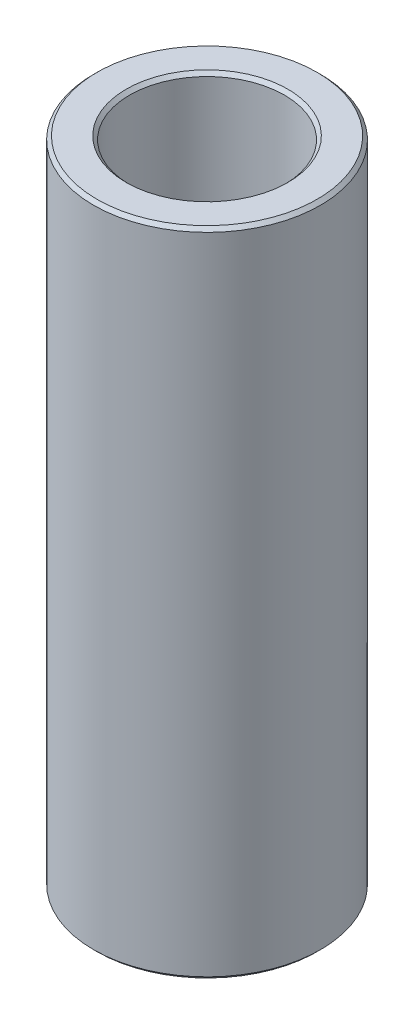
ISO-10303-21;
HEADER;
FILE_DESCRIPTION(('STEP AP214'),'2;1');
FILE_NAME('part.step','',(''),(''),'','','');
FILE_SCHEMA(('AUTOMOTIVE_DESIGN { 1 0 10303 214 1 1 1 1 }'));
ENDSEC;
DATA;
#1=APPLICATION_CONTEXT('core data for automotive mechanical design processes');
#2=APPLICATION_PROTOCOL_DEFINITION('international standard','automotive_design',2000,#1);
#3=PRODUCT_CONTEXT('',#1,'mechanical');
#4=PRODUCT('Part','Part','',(#3));
#5=PRODUCT_RELATED_PRODUCT_CATEGORY('part','',(#4));
#6=PRODUCT_DEFINITION_FORMATION('','',#4);
#7=PRODUCT_DEFINITION_CONTEXT('part definition',#1,'design');
#8=PRODUCT_DEFINITION('design','',#6,#7);
#9=PRODUCT_DEFINITION_SHAPE('','',#8);
#10=(LENGTH_UNIT() NAMED_UNIT(*) SI_UNIT(.MILLI.,.METRE.));
#11=(NAMED_UNIT(*) PLANE_ANGLE_UNIT() SI_UNIT($,.RADIAN.));
#12=(NAMED_UNIT(*) SI_UNIT($,.STERADIAN.) SOLID_ANGLE_UNIT());
#13=UNCERTAINTY_MEASURE_WITH_UNIT(LENGTH_MEASURE(1.E-05),#10,'distance_accuracy_value','');
#14=(GEOMETRIC_REPRESENTATION_CONTEXT(3) GLOBAL_UNCERTAINTY_ASSIGNED_CONTEXT((#13)) GLOBAL_UNIT_ASSIGNED_CONTEXT((#10,
#11,#12)) REPRESENTATION_CONTEXT('',''));
#15=CARTESIAN_POINT('',(0.,0.,0.));
#16=DIRECTION('',(0.,0.,1.));
#17=DIRECTION('',(1.,0.,0.));
#18=AXIS2_PLACEMENT_3D('',#15,#16,#17);
#19=CARTESIAN_POINT('',(0.,287.154505728759,0.));
#20=DIRECTION('',(0.,-1.,0.));
#21=DIRECTION('',(0.,0.,-1.));
#22=AXIS2_PLACEMENT_3D('',#19,#20,#21);
#23=CYLINDRICAL_SURFACE('',#22,50.);
#24=CARTESIAN_POINT('',(0.,1.50502864896784,0.));
#25=DIRECTION('',(0.,1.,0.));
#26=DIRECTION('',(0.,0.,1.));
#27=AXIS2_PLACEMENT_3D('',#24,#25,#26);
#28=CIRCLE('',#27,50.);
#29=CARTESIAN_POINT('',(0.,1.50502864896784,50.));
#30=VERTEX_POINT('',#29);
#31=EDGE_CURVE('E10',#30,#30,#28,.T.);
#32=ORIENTED_EDGE('',*,*,#31,.T.);
#33=EDGE_LOOP('',(#32));
#34=FACE_BOUND('',#33,.T.);
#35=CARTESIAN_POINT('',(0.,285.649477079791,0.));
#36=DIRECTION('',(0.,1.,0.));
#37=DIRECTION('',(0.,0.,1.));
#38=AXIS2_PLACEMENT_3D('',#35,#36,#37);
#39=CIRCLE('',#38,50.);
#40=CARTESIAN_POINT('',(0.,285.649477079791,50.));
#41=VERTEX_POINT('',#40);
#42=EDGE_CURVE('E50',#41,#41,#39,.F.);
#43=ORIENTED_EDGE('',*,*,#42,.T.);
#44=EDGE_LOOP('',(#43));
#45=FACE_BOUND('',#44,.T.);
#46=ADVANCED_FACE('F39',(#34,#45),#23,.T.);
#47=CARTESIAN_POINT('',(0.,287.154505728759,0.));
#48=DIRECTION('',(0.,1.,0.));
#49=DIRECTION('',(0.,0.,1.));
#50=AXIS2_PLACEMENT_3D('',#47,#48,#49);
#51=PLANE('',#50);
#52=CARTESIAN_POINT('',(0.,287.154505728759,0.));
#53=DIRECTION('',(0.,1.,0.));
#54=DIRECTION('',(0.,0.,1.));
#55=AXIS2_PLACEMENT_3D('',#52,#53,#54);
#56=CIRCLE('',#55,35.6343448382963);
#57=CARTESIAN_POINT('',(0.,287.154505728759,35.6343448382963));
#58=VERTEX_POINT('',#57);
#59=EDGE_CURVE('E58',#58,#58,#56,.F.);
#60=ORIENTED_EDGE('',*,*,#59,.T.);
#61=EDGE_LOOP('',(#60));
#62=FACE_BOUND('',#61,.T.);
#63=CARTESIAN_POINT('',(0.,287.154505728759,0.));
#64=DIRECTION('',(0.,1.,0.));
#65=DIRECTION('',(0.,0.,1.));
#66=AXIS2_PLACEMENT_3D('',#63,#64,#65);
#67=CIRCLE('',#66,48.4949713510322);
#68=CARTESIAN_POINT('',(0.,287.154505728759,48.4949713510322));
#69=VERTEX_POINT('',#68);
#70=EDGE_CURVE('E61',#69,#69,#67,.T.);
#71=ORIENTED_EDGE('',*,*,#70,.T.);
#72=EDGE_LOOP('',(#71));
#73=FACE_BOUND('',#72,.T.);
#74=ADVANCED_FACE('F88',(#62,#73),#51,.T.);
#75=CARTESIAN_POINT('',(0.,0.,0.));
#76=DIRECTION('',(0.,1.,0.));
#77=DIRECTION('',(0.,0.,1.));
#78=AXIS2_PLACEMENT_3D('',#75,#76,#77);
#79=PLANE('',#78);
#80=CARTESIAN_POINT('',(0.,0.,0.));
#81=DIRECTION('',(0.,1.,0.));
#82=DIRECTION('',(0.,0.,1.));
#83=AXIS2_PLACEMENT_3D('',#80,#81,#82);
#84=CIRCLE('',#83,35.6343448382963);
#85=CARTESIAN_POINT('',(0.,0.,35.6343448382963));
#86=VERTEX_POINT('',#85);
#87=EDGE_CURVE('E51',#86,#86,#84,.T.);
#88=ORIENTED_EDGE('',*,*,#87,.T.);
#89=EDGE_LOOP('',(#88));
#90=FACE_BOUND('',#89,.T.);
#91=CARTESIAN_POINT('',(0.,0.,0.));
#92=DIRECTION('',(0.,1.,0.));
#93=DIRECTION('',(0.,0.,1.));
#94=AXIS2_PLACEMENT_3D('',#91,#92,#93);
#95=CIRCLE('',#94,48.4949713510322);
#96=CARTESIAN_POINT('',(0.,0.,48.4949713510322));
#97=VERTEX_POINT('',#96);
#98=EDGE_CURVE('E54',#97,#97,#95,.F.);
#99=ORIENTED_EDGE('',*,*,#98,.T.);
#100=EDGE_LOOP('',(#99));
#101=FACE_BOUND('',#100,.T.);
#102=ADVANCED_FACE('F83',(#90,#101),#79,.F.);
#103=CARTESIAN_POINT('',(0.,287.154505728759,0.));
#104=DIRECTION('',(0.,-1.,0.));
#105=DIRECTION('',(0.,0.,-1.));
#106=AXIS2_PLACEMENT_3D('',#103,#104,#105);
#107=CYLINDRICAL_SURFACE('',#106,34.1293161893284);
#108=CARTESIAN_POINT('',(0.,285.649477079791,0.));
#109=DIRECTION('',(0.,1.,0.));
#110=DIRECTION('',(0.,0.,1.));
#111=AXIS2_PLACEMENT_3D('',#108,#109,#110);
#112=CIRCLE('',#111,34.1293161893284);
#113=CARTESIAN_POINT('',(0.,285.649477079791,34.1293161893284));
#114=VERTEX_POINT('',#113);
#115=EDGE_CURVE('E67',#114,#114,#112,.T.);
#116=ORIENTED_EDGE('',*,*,#115,.T.);
#117=EDGE_LOOP('',(#116));
#118=FACE_BOUND('',#117,.T.);
#119=CARTESIAN_POINT('',(0.,1.50502864896784,0.));
#120=DIRECTION('',(0.,1.,0.));
#121=DIRECTION('',(0.,0.,1.));
#122=AXIS2_PLACEMENT_3D('',#119,#120,#121);
#123=CIRCLE('',#122,34.1293161893284);
#124=CARTESIAN_POINT('',(0.,1.50502864896784,34.1293161893284));
#125=VERTEX_POINT('',#124);
#126=EDGE_CURVE('E69',#125,#125,#123,.F.);
#127=ORIENTED_EDGE('',*,*,#126,.T.);
#128=EDGE_LOOP('',(#127));
#129=FACE_BOUND('',#128,.T.);
#130=ADVANCED_FACE('F71',(#118,#129),#107,.F.);
#131=CARTESIAN_POINT('',(0.,285.649477079791,0.));
#132=DIRECTION('',(0.,1.,0.));
#133=DIRECTION('',(0.,0.,1.));
#134=AXIS2_PLACEMENT_3D('',#131,#132,#133);
#135=CONICAL_SURFACE('',#134,34.1293161893284,0.785398163397439);
#136=ORIENTED_EDGE('',*,*,#59,.F.);
#137=EDGE_LOOP('',(#136));
#138=FACE_BOUND('',#137,.T.);
#139=ORIENTED_EDGE('',*,*,#115,.F.);
#140=EDGE_LOOP('',(#139));
#141=FACE_BOUND('',#140,.T.);
#142=ADVANCED_FACE('F77',(#138,#141),#135,.F.);
#143=CARTESIAN_POINT('',(0.,0.,0.));
#144=DIRECTION('',(0.,-1.,0.));
#145=DIRECTION('',(0.,0.,-1.));
#146=AXIS2_PLACEMENT_3D('',#143,#144,#145);
#147=CONICAL_SURFACE('',#146,35.6343448382963,0.785398163397448);
#148=ORIENTED_EDGE('',*,*,#126,.F.);
#149=EDGE_LOOP('',(#148));
#150=FACE_BOUND('',#149,.T.);
#151=ORIENTED_EDGE('',*,*,#87,.F.);
#152=EDGE_LOOP('',(#151));
#153=FACE_BOUND('',#152,.T.);
#154=ADVANCED_FACE('F73',(#150,#153),#147,.F.);
#155=CARTESIAN_POINT('',(0.,1.50502864896784,0.));
#156=DIRECTION('',(0.,1.,0.));
#157=DIRECTION('',(0.,0.,1.));
#158=AXIS2_PLACEMENT_3D('',#155,#156,#157);
#159=CONICAL_SURFACE('',#158,50.,0.785398163397441);
#160=ORIENTED_EDGE('',*,*,#98,.F.);
#161=EDGE_LOOP('',(#160));
#162=FACE_BOUND('',#161,.T.);
#163=ORIENTED_EDGE('',*,*,#31,.F.);
#164=EDGE_LOOP('',(#163));
#165=FACE_BOUND('',#164,.T.);
#166=ADVANCED_FACE('F76',(#162,#165),#159,.T.);
#167=CARTESIAN_POINT('',(0.,287.154505728759,0.));
#168=DIRECTION('',(0.,-1.,0.));
#169=DIRECTION('',(0.,0.,-1.));
#170=AXIS2_PLACEMENT_3D('',#167,#168,#169);
#171=CONICAL_SURFACE('',#170,48.4949713510322,0.785398163397444);
#172=ORIENTED_EDGE('',*,*,#42,.F.);
#173=EDGE_LOOP('',(#172));
#174=FACE_BOUND('',#173,.T.);
#175=ORIENTED_EDGE('',*,*,#70,.F.);
#176=EDGE_LOOP('',(#175));
#177=FACE_BOUND('',#176,.T.);
#178=ADVANCED_FACE('F45',(#174,#177),#171,.T.);
#179=CLOSED_SHELL('',(#46,#74,#102,#130,#142,#154,#166,#178));
#180=MANIFOLD_SOLID_BREP('B2',#179);
#181=ADVANCED_BREP_SHAPE_REPRESENTATION('',(#18,#180),#14);
#182=SHAPE_DEFINITION_REPRESENTATION(#9,#181);
ENDSEC;
END-ISO-10303-21;
